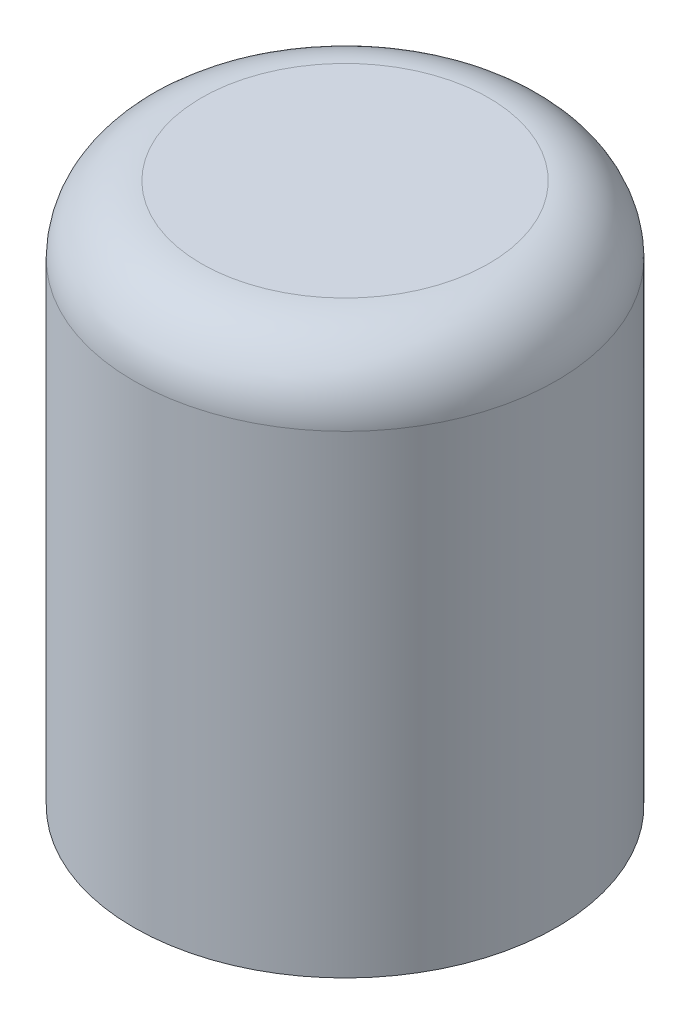
ISO-10303-21;
HEADER;
FILE_DESCRIPTION(('STEP AP214'),'2;1');
FILE_NAME('part.step','',(''),(''),'','','');
FILE_SCHEMA(('AUTOMOTIVE_DESIGN { 1 0 10303 214 1 1 1 1 }'));
ENDSEC;
DATA;
#1=APPLICATION_CONTEXT('core data for automotive mechanical design processes');
#2=APPLICATION_PROTOCOL_DEFINITION('international standard','automotive_design',2000,#1);
#3=PRODUCT_CONTEXT('',#1,'mechanical');
#4=PRODUCT('Part','Part','',(#3));
#5=PRODUCT_RELATED_PRODUCT_CATEGORY('part','',(#4));
#6=PRODUCT_DEFINITION_FORMATION('','',#4);
#7=PRODUCT_DEFINITION_CONTEXT('part definition',#1,'design');
#8=PRODUCT_DEFINITION('design','',#6,#7);
#9=PRODUCT_DEFINITION_SHAPE('','',#8);
#10=(LENGTH_UNIT() NAMED_UNIT(*) SI_UNIT(.MILLI.,.METRE.));
#11=(NAMED_UNIT(*) PLANE_ANGLE_UNIT() SI_UNIT($,.RADIAN.));
#12=(NAMED_UNIT(*) SI_UNIT($,.STERADIAN.) SOLID_ANGLE_UNIT());
#13=UNCERTAINTY_MEASURE_WITH_UNIT(LENGTH_MEASURE(1.E-05),#10,'distance_accuracy_value','');
#14=(GEOMETRIC_REPRESENTATION_CONTEXT(3) GLOBAL_UNCERTAINTY_ASSIGNED_CONTEXT((#13)) GLOBAL_UNIT_ASSIGNED_CONTEXT((#10,
#11,#12)) REPRESENTATION_CONTEXT('',''));
#15=CARTESIAN_POINT('',(0.,0.,0.));
#16=DIRECTION('',(0.,0.,1.));
#17=DIRECTION('',(1.,0.,0.));
#18=AXIS2_PLACEMENT_3D('',#15,#16,#17);
#19=CARTESIAN_POINT('',(0.,8.,0.));
#20=DIRECTION('',(0.,-1.,0.));
#21=DIRECTION('',(0.,0.,-1.));
#22=AXIS2_PLACEMENT_3D('',#19,#20,#21);
#23=CYLINDRICAL_SURFACE('',#22,3.125);
#24=CARTESIAN_POINT('',(0.,7.,0.));
#25=DIRECTION('',(0.,1.,0.));
#26=DIRECTION('',(0.,0.,1.));
#27=AXIS2_PLACEMENT_3D('',#24,#25,#26);
#28=CIRCLE('',#27,3.125);
#29=CARTESIAN_POINT('',(0.,7.,3.125));
#30=VERTEX_POINT('',#29);
#31=EDGE_CURVE('E11',#30,#30,#28,.F.);
#32=ORIENTED_EDGE('',*,*,#31,.T.);
#33=EDGE_LOOP('',(#32));
#34=FACE_BOUND('',#33,.T.);
#35=CARTESIAN_POINT('',(0.,0.,0.));
#36=DIRECTION('',(0.,1.,0.));
#37=DIRECTION('',(0.,0.,1.));
#38=AXIS2_PLACEMENT_3D('',#35,#36,#37);
#39=CIRCLE('',#38,3.125);
#40=CARTESIAN_POINT('',(0.,0.,3.125));
#41=VERTEX_POINT('',#40);
#42=EDGE_CURVE('E126',#41,#41,#39,.T.);
#43=ORIENTED_EDGE('',*,*,#42,.T.);
#44=EDGE_LOOP('',(#43));
#45=FACE_BOUND('',#44,.T.);
#46=ADVANCED_FACE('F39',(#34,#45),#23,.T.);
#47=CARTESIAN_POINT('',(0.,8.,0.));
#48=DIRECTION('',(0.,1.,0.));
#49=DIRECTION('',(0.,0.,1.));
#50=AXIS2_PLACEMENT_3D('',#47,#48,#49);
#51=PLANE('',#50);
#52=CARTESIAN_POINT('',(0.,8.,0.));
#53=DIRECTION('',(0.,1.,0.));
#54=DIRECTION('',(0.,0.,1.));
#55=AXIS2_PLACEMENT_3D('',#52,#53,#54);
#56=CIRCLE('',#55,2.125);
#57=CARTESIAN_POINT('',(0.,8.,2.125));
#58=VERTEX_POINT('',#57);
#59=EDGE_CURVE('E48',#58,#58,#56,.T.);
#60=ORIENTED_EDGE('',*,*,#59,.T.);
#61=EDGE_LOOP('',(#60));
#62=FACE_BOUND('',#61,.T.);
#63=ADVANCED_FACE('F137',(#62),#51,.T.);
#64=CARTESIAN_POINT('',(0.,0.,0.));
#65=DIRECTION('',(0.,1.,0.));
#66=DIRECTION('',(0.,0.,1.));
#67=AXIS2_PLACEMENT_3D('',#64,#65,#66);
#68=PLANE('',#67);
#69=DIRECTION('',(-1.,0.,0.));
#70=VECTOR('',#69,1.);
#71=CARTESIAN_POINT('',(-1.125,0.,1.625));
#72=LINE('',#71,#70);
#73=CARTESIAN_POINT('',(1.125,0.,1.625));
#74=VERTEX_POINT('',#73);
#75=CARTESIAN_POINT('',(-1.125,0.,1.625));
#76=VERTEX_POINT('',#75);
#77=EDGE_CURVE('E90',#74,#76,#72,.T.);
#78=ORIENTED_EDGE('',*,*,#77,.F.);
#79=DIRECTION('',(0.,0.,1.));
#80=VECTOR('',#79,1.);
#81=CARTESIAN_POINT('',(1.125,0.,-1.625));
#82=LINE('',#81,#80);
#83=CARTESIAN_POINT('',(1.125,0.,-1.625));
#84=VERTEX_POINT('',#83);
#85=EDGE_CURVE('E55',#84,#74,#82,.T.);
#86=ORIENTED_EDGE('',*,*,#85,.F.);
#87=DIRECTION('',(1.,0.,0.));
#88=VECTOR('',#87,1.);
#89=CARTESIAN_POINT('',(-1.125,0.,-1.625));
#90=LINE('',#89,#88);
#91=CARTESIAN_POINT('',(-1.125,0.,-1.625));
#92=VERTEX_POINT('',#91);
#93=EDGE_CURVE('E110',#92,#84,#90,.T.);
#94=ORIENTED_EDGE('',*,*,#93,.F.);
#95=DIRECTION('',(0.,0.,-1.));
#96=VECTOR('',#95,1.);
#97=CARTESIAN_POINT('',(-1.125,0.,-1.625));
#98=LINE('',#97,#96);
#99=EDGE_CURVE('E119',#76,#92,#98,.T.);
#100=ORIENTED_EDGE('',*,*,#99,.F.);
#101=EDGE_LOOP('',(#78,#86,#94,#100));
#102=FACE_BOUND('',#101,.T.);
#103=ORIENTED_EDGE('',*,*,#42,.F.);
#104=EDGE_LOOP('',(#103));
#105=FACE_BOUND('',#104,.T.);
#106=ADVANCED_FACE('F151',(#102,#105),#68,.F.);
#107=CARTESIAN_POINT('',(1.125,3.,-1.625));
#108=DIRECTION('',(1.,0.,0.));
#109=DIRECTION('',(0.,0.,-1.));
#110=AXIS2_PLACEMENT_3D('',#107,#108,#109);
#111=PLANE('',#110);
#112=ORIENTED_EDGE('',*,*,#85,.T.);
#113=DIRECTION('',(0.,-1.,0.));
#114=VECTOR('',#113,1.);
#115=CARTESIAN_POINT('',(1.125,3.,1.625));
#116=LINE('',#115,#114);
#117=CARTESIAN_POINT('',(1.125,3.,1.625));
#118=VERTEX_POINT('',#117);
#119=EDGE_CURVE('E78',#118,#74,#116,.T.);
#120=ORIENTED_EDGE('',*,*,#119,.F.);
#121=DIRECTION('',(0.,0.,1.));
#122=VECTOR('',#121,1.);
#123=CARTESIAN_POINT('',(1.125,3.,-1.625));
#124=LINE('',#123,#122);
#125=CARTESIAN_POINT('',(1.125,3.,-1.625));
#126=VERTEX_POINT('',#125);
#127=EDGE_CURVE('E106',#126,#118,#124,.T.);
#128=ORIENTED_EDGE('',*,*,#127,.F.);
#129=DIRECTION('',(0.,-1.,0.));
#130=VECTOR('',#129,1.);
#131=CARTESIAN_POINT('',(1.125,3.,-1.625));
#132=LINE('',#131,#130);
#133=EDGE_CURVE('E63',#126,#84,#132,.T.);
#134=ORIENTED_EDGE('',*,*,#133,.T.);
#135=EDGE_LOOP('',(#112,#120,#128,#134));
#136=FACE_BOUND('',#135,.T.);
#137=ADVANCED_FACE('F156',(#136),#111,.F.);
#138=CARTESIAN_POINT('',(-1.125,3.,-1.625));
#139=DIRECTION('',(0.,0.,-1.));
#140=DIRECTION('',(-1.,0.,0.));
#141=AXIS2_PLACEMENT_3D('',#138,#139,#140);
#142=PLANE('',#141);
#143=ORIENTED_EDGE('',*,*,#93,.T.);
#144=ORIENTED_EDGE('',*,*,#133,.F.);
#145=DIRECTION('',(1.,0.,0.));
#146=VECTOR('',#145,1.);
#147=CARTESIAN_POINT('',(-1.125,3.,-1.625));
#148=LINE('',#147,#146);
#149=CARTESIAN_POINT('',(-1.125,3.,-1.625));
#150=VERTEX_POINT('',#149);
#151=EDGE_CURVE('E103',#150,#126,#148,.T.);
#152=ORIENTED_EDGE('',*,*,#151,.F.);
#153=DIRECTION('',(0.,-1.,0.));
#154=VECTOR('',#153,1.);
#155=CARTESIAN_POINT('',(-1.125,3.,-1.625));
#156=LINE('',#155,#154);
#157=EDGE_CURVE('E95',#150,#92,#156,.T.);
#158=ORIENTED_EDGE('',*,*,#157,.T.);
#159=EDGE_LOOP('',(#143,#144,#152,#158));
#160=FACE_BOUND('',#159,.T.);
#161=ADVANCED_FACE('F161',(#160),#142,.F.);
#162=CARTESIAN_POINT('',(-1.125,3.,-1.625));
#163=DIRECTION('',(-1.,0.,0.));
#164=DIRECTION('',(0.,0.,1.));
#165=AXIS2_PLACEMENT_3D('',#162,#163,#164);
#166=PLANE('',#165);
#167=ORIENTED_EDGE('',*,*,#99,.T.);
#168=ORIENTED_EDGE('',*,*,#157,.F.);
#169=DIRECTION('',(0.,0.,-1.));
#170=VECTOR('',#169,1.);
#171=CARTESIAN_POINT('',(-1.125,3.,-1.625));
#172=LINE('',#171,#170);
#173=CARTESIAN_POINT('',(-1.125,3.,1.625));
#174=VERTEX_POINT('',#173);
#175=EDGE_CURVE('E98',#174,#150,#172,.T.);
#176=ORIENTED_EDGE('',*,*,#175,.F.);
#177=DIRECTION('',(0.,-1.,0.));
#178=VECTOR('',#177,1.);
#179=CARTESIAN_POINT('',(-1.125,3.,1.625));
#180=LINE('',#179,#178);
#181=EDGE_CURVE('E83',#174,#76,#180,.T.);
#182=ORIENTED_EDGE('',*,*,#181,.T.);
#183=EDGE_LOOP('',(#167,#168,#176,#182));
#184=FACE_BOUND('',#183,.T.);
#185=ADVANCED_FACE('F99',(#184),#166,.F.);
#186=CARTESIAN_POINT('',(-1.125,3.,1.625));
#187=DIRECTION('',(0.,0.,1.));
#188=DIRECTION('',(1.,0.,0.));
#189=AXIS2_PLACEMENT_3D('',#186,#187,#188);
#190=PLANE('',#189);
#191=ORIENTED_EDGE('',*,*,#77,.T.);
#192=ORIENTED_EDGE('',*,*,#181,.F.);
#193=DIRECTION('',(-1.,0.,0.));
#194=VECTOR('',#193,1.);
#195=CARTESIAN_POINT('',(-1.125,3.,1.625));
#196=LINE('',#195,#194);
#197=EDGE_CURVE('E87',#118,#174,#196,.T.);
#198=ORIENTED_EDGE('',*,*,#197,.F.);
#199=ORIENTED_EDGE('',*,*,#119,.T.);
#200=EDGE_LOOP('',(#191,#192,#198,#199));
#201=FACE_BOUND('',#200,.T.);
#202=ADVANCED_FACE('F85',(#201),#190,.F.);
#203=CARTESIAN_POINT('',(0.,3.,0.));
#204=DIRECTION('',(0.,1.,0.));
#205=DIRECTION('',(0.,0.,1.));
#206=AXIS2_PLACEMENT_3D('',#203,#204,#205);
#207=PLANE('',#206);
#208=ORIENTED_EDGE('',*,*,#127,.T.);
#209=ORIENTED_EDGE('',*,*,#197,.T.);
#210=ORIENTED_EDGE('',*,*,#175,.T.);
#211=ORIENTED_EDGE('',*,*,#151,.T.);
#212=EDGE_LOOP('',(#208,#209,#210,#211));
#213=FACE_BOUND('',#212,.T.);
#214=ADVANCED_FACE('F105',(#213),#207,.F.);
#215=CARTESIAN_POINT('',(0.,7.,0.));
#216=DIRECTION('',(0.,1.,0.));
#217=DIRECTION('',(0.,0.,1.));
#218=AXIS2_PLACEMENT_3D('',#215,#216,#217);
#219=TOROIDAL_SURFACE('',#218,2.125,1.);
#220=ORIENTED_EDGE('',*,*,#31,.F.);
#221=EDGE_LOOP('',(#220));
#222=FACE_BOUND('',#221,.T.);
#223=ORIENTED_EDGE('',*,*,#59,.F.);
#224=EDGE_LOOP('',(#223));
#225=FACE_BOUND('',#224,.T.);
#226=ADVANCED_FACE('F41',(#222,#225),#219,.T.);
#227=CLOSED_SHELL('',(#46,#63,#106,#137,#161,#185,#202,#214,#226));
#228=MANIFOLD_SOLID_BREP('B2',#227);
#229=ADVANCED_BREP_SHAPE_REPRESENTATION('',(#18,#228),#14);
#230=SHAPE_DEFINITION_REPRESENTATION(#9,#229);
ENDSEC;
END-ISO-10303-21;
